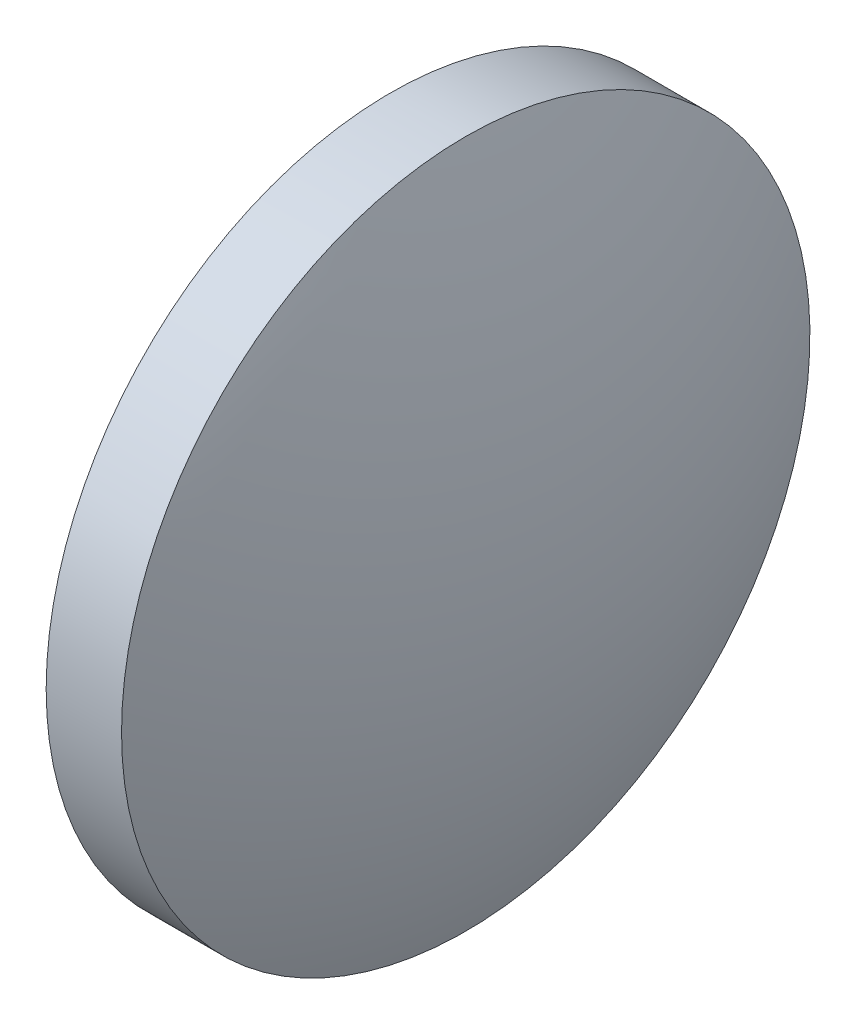
ISO-10303-21;
HEADER;
FILE_DESCRIPTION(('STEP AP214'),'2;1');
FILE_NAME('part.step','',(''),(''),'','','');
FILE_SCHEMA(('AUTOMOTIVE_DESIGN { 1 0 10303 214 1 1 1 1 }'));
ENDSEC;
DATA;
#1=APPLICATION_CONTEXT('core data for automotive mechanical design processes');
#2=APPLICATION_PROTOCOL_DEFINITION('international standard','automotive_design',2000,#1);
#3=PRODUCT_CONTEXT('',#1,'mechanical');
#4=PRODUCT('Part','Part','',(#3));
#5=PRODUCT_RELATED_PRODUCT_CATEGORY('part','',(#4));
#6=PRODUCT_DEFINITION_FORMATION('','',#4);
#7=PRODUCT_DEFINITION_CONTEXT('part definition',#1,'design');
#8=PRODUCT_DEFINITION('design','',#6,#7);
#9=PRODUCT_DEFINITION_SHAPE('','',#8);
#10=(LENGTH_UNIT() NAMED_UNIT(*) SI_UNIT(.MILLI.,.METRE.));
#11=(NAMED_UNIT(*) PLANE_ANGLE_UNIT() SI_UNIT($,.RADIAN.));
#12=(NAMED_UNIT(*) SI_UNIT($,.STERADIAN.) SOLID_ANGLE_UNIT());
#13=UNCERTAINTY_MEASURE_WITH_UNIT(LENGTH_MEASURE(1.E-05),#10,'distance_accuracy_value','');
#14=(GEOMETRIC_REPRESENTATION_CONTEXT(3) GLOBAL_UNCERTAINTY_ASSIGNED_CONTEXT((#13)) GLOBAL_UNIT_ASSIGNED_CONTEXT((#10,
#11,#12)) REPRESENTATION_CONTEXT('',''));
#15=CARTESIAN_POINT('',(0.,0.,0.));
#16=DIRECTION('',(0.,0.,1.));
#17=DIRECTION('',(1.,0.,0.));
#18=AXIS2_PLACEMENT_3D('',#15,#16,#17);
#19=CARTESIAN_POINT('',(529.585952345947,125.172067176133,0.));
#20=DIRECTION('',(-1.,0.,0.));
#21=DIRECTION('',(0.,1.,0.));
#22=AXIS2_PLACEMENT_3D('',#19,#20,#21);
#23=SPHERICAL_SURFACE('',#22,25.8806218905473);
#24=CARTESIAN_POINT('',(553.456574236494,125.172067176134,0.));
#25=DIRECTION('',(-1.,0.,0.));
#26=DIRECTION('',(0.,0.,1.));
#27=AXIS2_PLACEMENT_3D('',#24,#25,#26);
#28=CIRCLE('',#27,9.99999999999998);
#29=CARTESIAN_POINT('',(553.456574236494,125.172067176134,9.99999999999998));
#30=VERTEX_POINT('',#29);
#31=EDGE_CURVE('E10',#30,#30,#28,.T.);
#32=ORIENTED_EDGE('',*,*,#31,.F.);
#33=EDGE_LOOP('',(#32));
#34=FACE_BOUND('',#33,.T.);
#35=ADVANCED_FACE('F35',(#34),#23,.T.);
#36=CARTESIAN_POINT('',(548.863053355437,125.172067176134,0.));
#37=DIRECTION('',(-1.,0.,0.));
#38=DIRECTION('',(0.,0.,1.));
#39=AXIS2_PLACEMENT_3D('',#36,#37,#38);
#40=CYLINDRICAL_SURFACE('',#39,9.99999999999998);
#41=CARTESIAN_POINT('',(551.266574236494,125.172067176134,0.));
#42=DIRECTION('',(-1.,0.,0.));
#43=DIRECTION('',(0.,0.,1.));
#44=AXIS2_PLACEMENT_3D('',#41,#42,#43);
#45=CIRCLE('',#44,9.99999999999998);
#46=CARTESIAN_POINT('',(551.266574236494,125.172067176134,9.99999999999998));
#47=VERTEX_POINT('',#46);
#48=EDGE_CURVE('E41',#47,#47,#45,.T.);
#49=ORIENTED_EDGE('',*,*,#48,.F.);
#50=EDGE_LOOP('',(#49));
#51=FACE_BOUND('',#50,.T.);
#52=ORIENTED_EDGE('',*,*,#31,.T.);
#53=EDGE_LOOP('',(#52));
#54=FACE_BOUND('',#53,.T.);
#55=ADVANCED_FACE('F49',(#51,#54),#40,.T.);
#56=CARTESIAN_POINT('',(551.266574236494,125.172067176134,0.));
#57=DIRECTION('',(1.,0.,0.));
#58=DIRECTION('',(0.,0.,-1.));
#59=AXIS2_PLACEMENT_3D('',#56,#57,#58);
#60=PLANE('',#59);
#61=ORIENTED_EDGE('',*,*,#48,.T.);
#62=EDGE_LOOP('',(#61));
#63=FACE_BOUND('',#62,.T.);
#64=ADVANCED_FACE('F47',(#63),#60,.F.);
#65=CLOSED_SHELL('',(#35,#55,#64));
#66=MANIFOLD_SOLID_BREP('B2',#65);
#67=ADVANCED_BREP_SHAPE_REPRESENTATION('',(#18,#66),#14);
#68=SHAPE_DEFINITION_REPRESENTATION(#9,#67);
ENDSEC;
END-ISO-10303-21;
